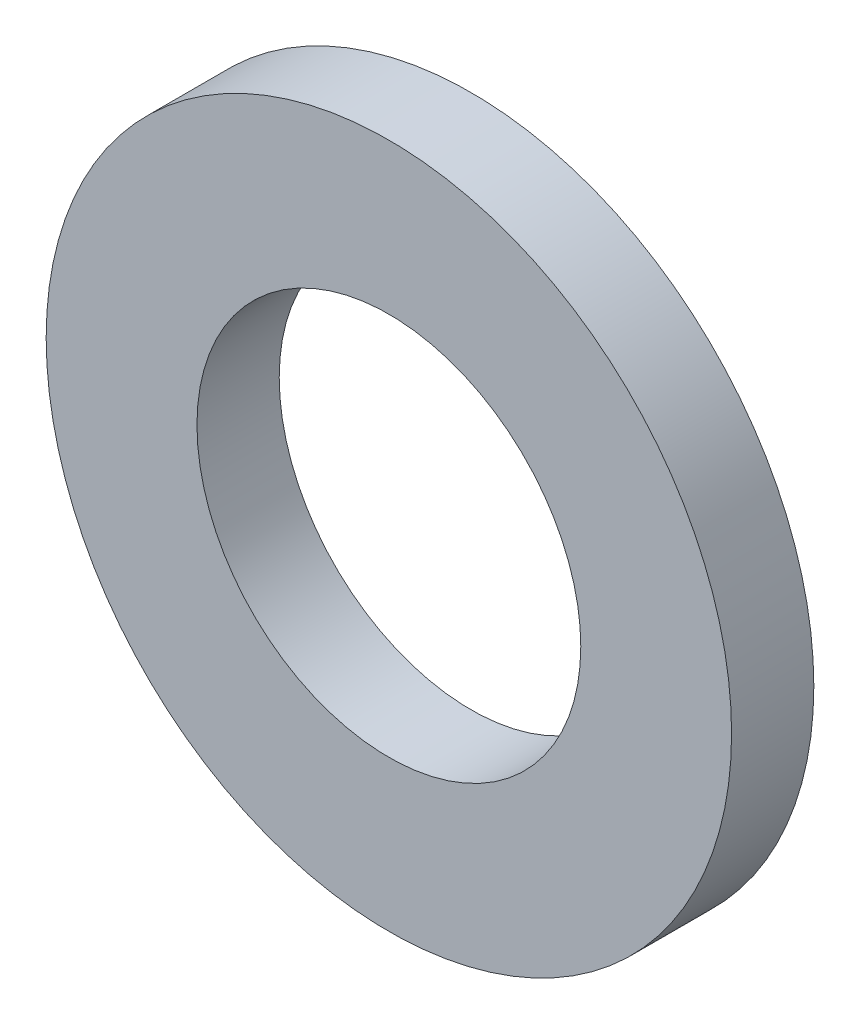
ISO-10303-21;
HEADER;
FILE_DESCRIPTION(('STEP AP214'),'2;1');
FILE_NAME('part.step','',(''),(''),'','','');
FILE_SCHEMA(('AUTOMOTIVE_DESIGN { 1 0 10303 214 1 1 1 1 }'));
ENDSEC;
DATA;
#1=APPLICATION_CONTEXT('core data for automotive mechanical design processes');
#2=APPLICATION_PROTOCOL_DEFINITION('international standard','automotive_design',2000,#1);
#3=PRODUCT_CONTEXT('',#1,'mechanical');
#4=PRODUCT('Part','Part','',(#3));
#5=PRODUCT_RELATED_PRODUCT_CATEGORY('part','',(#4));
#6=PRODUCT_DEFINITION_FORMATION('','',#4);
#7=PRODUCT_DEFINITION_CONTEXT('part definition',#1,'design');
#8=PRODUCT_DEFINITION('design','',#6,#7);
#9=PRODUCT_DEFINITION_SHAPE('','',#8);
#10=(LENGTH_UNIT() NAMED_UNIT(*) SI_UNIT(.MILLI.,.METRE.));
#11=(NAMED_UNIT(*) PLANE_ANGLE_UNIT() SI_UNIT($,.RADIAN.));
#12=(NAMED_UNIT(*) SI_UNIT($,.STERADIAN.) SOLID_ANGLE_UNIT());
#13=UNCERTAINTY_MEASURE_WITH_UNIT(LENGTH_MEASURE(1.E-05),#10,'distance_accuracy_value','');
#14=(GEOMETRIC_REPRESENTATION_CONTEXT(3) GLOBAL_UNCERTAINTY_ASSIGNED_CONTEXT((#13)) GLOBAL_UNIT_ASSIGNED_CONTEXT((#10,
#11,#12)) REPRESENTATION_CONTEXT('',''));
#15=CARTESIAN_POINT('',(0.,0.,0.));
#16=DIRECTION('',(0.,0.,1.));
#17=DIRECTION('',(1.,0.,0.));
#18=AXIS2_PLACEMENT_3D('',#15,#16,#17);
#19=CARTESIAN_POINT('',(0.,0.,1.8));
#20=DIRECTION('',(0.,0.,1.));
#21=DIRECTION('',(1.,0.,0.));
#22=AXIS2_PLACEMENT_3D('',#19,#20,#21);
#23=PLANE('',#22);
#24=CARTESIAN_POINT('',(0.,0.,1.8));
#25=DIRECTION('',(0.,0.,1.));
#26=DIRECTION('',(1.,0.,0.));
#27=AXIS2_PLACEMENT_3D('',#24,#25,#26);
#28=CIRCLE('',#27,7.5);
#29=CARTESIAN_POINT('',(7.5,0.,1.8));
#30=VERTEX_POINT('',#29);
#31=EDGE_CURVE('E10',#30,#30,#28,.T.);
#32=ORIENTED_EDGE('',*,*,#31,.T.);
#33=EDGE_LOOP('',(#32));
#34=FACE_BOUND('',#33,.T.);
#35=CARTESIAN_POINT('',(0.,0.,1.8));
#36=DIRECTION('',(0.,0.,1.));
#37=DIRECTION('',(1.,0.,0.));
#38=AXIS2_PLACEMENT_3D('',#35,#36,#37);
#39=CIRCLE('',#38,4.2);
#40=CARTESIAN_POINT('',(4.2,0.,1.8));
#41=VERTEX_POINT('',#40);
#42=EDGE_CURVE('E44',#41,#41,#39,.T.);
#43=ORIENTED_EDGE('',*,*,#42,.F.);
#44=EDGE_LOOP('',(#43));
#45=FACE_BOUND('',#44,.T.);
#46=ADVANCED_FACE('F33',(#34,#45),#23,.T.);
#47=CARTESIAN_POINT('',(0.,0.,0.));
#48=DIRECTION('',(0.,0.,1.));
#49=DIRECTION('',(1.,0.,0.));
#50=AXIS2_PLACEMENT_3D('',#47,#48,#49);
#51=PLANE('',#50);
#52=CARTESIAN_POINT('',(0.,0.,0.));
#53=DIRECTION('',(0.,0.,1.));
#54=DIRECTION('',(1.,0.,0.));
#55=AXIS2_PLACEMENT_3D('',#52,#53,#54);
#56=CIRCLE('',#55,7.5);
#57=CARTESIAN_POINT('',(7.5,0.,0.));
#58=VERTEX_POINT('',#57);
#59=EDGE_CURVE('E37',#58,#58,#56,.T.);
#60=ORIENTED_EDGE('',*,*,#59,.F.);
#61=EDGE_LOOP('',(#60));
#62=FACE_BOUND('',#61,.T.);
#63=CARTESIAN_POINT('',(0.,0.,0.));
#64=DIRECTION('',(0.,0.,1.));
#65=DIRECTION('',(1.,0.,0.));
#66=AXIS2_PLACEMENT_3D('',#63,#64,#65);
#67=CIRCLE('',#66,4.2);
#68=CARTESIAN_POINT('',(4.2,0.,0.));
#69=VERTEX_POINT('',#68);
#70=EDGE_CURVE('E46',#69,#69,#67,.T.);
#71=ORIENTED_EDGE('',*,*,#70,.T.);
#72=EDGE_LOOP('',(#71));
#73=FACE_BOUND('',#72,.T.);
#74=ADVANCED_FACE('F56',(#62,#73),#51,.F.);
#75=CARTESIAN_POINT('',(0.,0.,1.8));
#76=DIRECTION('',(0.,0.,-1.));
#77=DIRECTION('',(-1.,0.,0.));
#78=AXIS2_PLACEMENT_3D('',#75,#76,#77);
#79=CYLINDRICAL_SURFACE('',#78,7.5);
#80=ORIENTED_EDGE('',*,*,#31,.F.);
#81=EDGE_LOOP('',(#80));
#82=FACE_BOUND('',#81,.T.);
#83=ORIENTED_EDGE('',*,*,#59,.T.);
#84=EDGE_LOOP('',(#83));
#85=FACE_BOUND('',#84,.T.);
#86=ADVANCED_FACE('F35',(#82,#85),#79,.T.);
#87=CARTESIAN_POINT('',(0.,0.,1.8));
#88=DIRECTION('',(0.,0.,-1.));
#89=DIRECTION('',(-1.,0.,0.));
#90=AXIS2_PLACEMENT_3D('',#87,#88,#89);
#91=CYLINDRICAL_SURFACE('',#90,4.2);
#92=ORIENTED_EDGE('',*,*,#42,.T.);
#93=EDGE_LOOP('',(#92));
#94=FACE_BOUND('',#93,.T.);
#95=ORIENTED_EDGE('',*,*,#70,.F.);
#96=EDGE_LOOP('',(#95));
#97=FACE_BOUND('',#96,.T.);
#98=ADVANCED_FACE('F52',(#94,#97),#91,.F.);
#99=CLOSED_SHELL('',(#46,#74,#86,#98));
#100=MANIFOLD_SOLID_BREP('B2',#99);
#101=ADVANCED_BREP_SHAPE_REPRESENTATION('',(#18,#100),#14);
#102=SHAPE_DEFINITION_REPRESENTATION(#9,#101);
ENDSEC;
END-ISO-10303-21;
